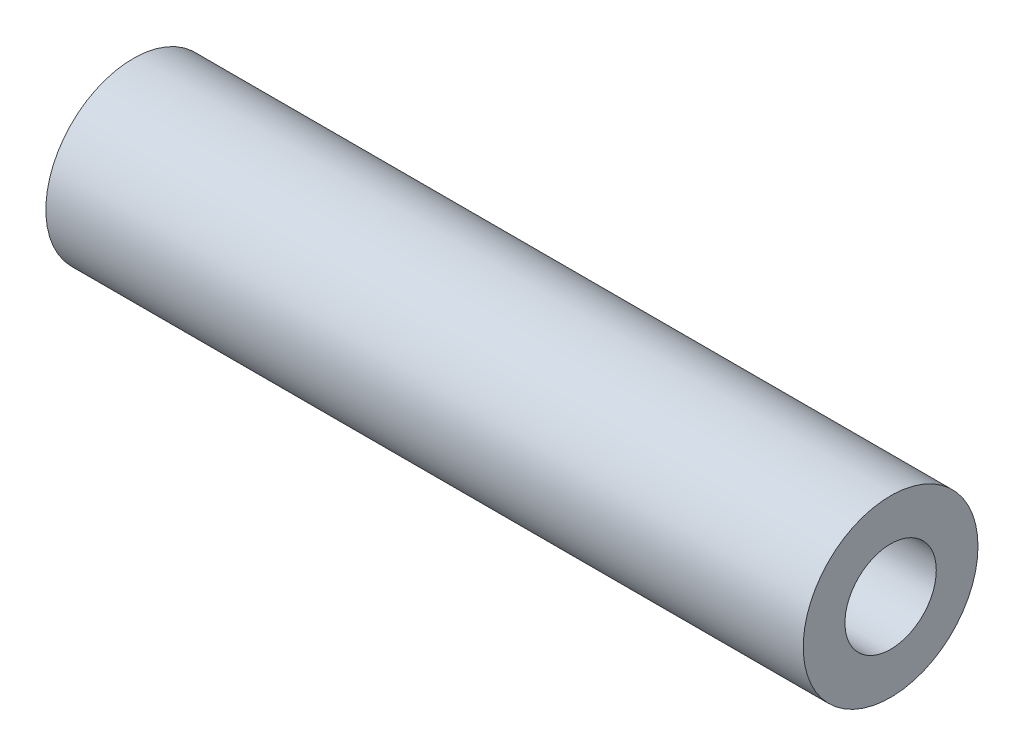
ISO-10303-21;
HEADER;
FILE_DESCRIPTION(('STEP AP214'),'2;1');
FILE_NAME('part.step','',(''),(''),'','','');
FILE_SCHEMA(('AUTOMOTIVE_DESIGN { 1 0 10303 214 1 1 1 1 }'));
ENDSEC;
DATA;
#1=APPLICATION_CONTEXT('core data for automotive mechanical design processes');
#2=APPLICATION_PROTOCOL_DEFINITION('international standard','automotive_design',2000,#1);
#3=PRODUCT_CONTEXT('',#1,'mechanical');
#4=PRODUCT('Part','Part','',(#3));
#5=PRODUCT_RELATED_PRODUCT_CATEGORY('part','',(#4));
#6=PRODUCT_DEFINITION_FORMATION('','',#4);
#7=PRODUCT_DEFINITION_CONTEXT('part definition',#1,'design');
#8=PRODUCT_DEFINITION('design','',#6,#7);
#9=PRODUCT_DEFINITION_SHAPE('','',#8);
#10=(LENGTH_UNIT() NAMED_UNIT(*) SI_UNIT(.MILLI.,.METRE.));
#11=(NAMED_UNIT(*) PLANE_ANGLE_UNIT() SI_UNIT($,.RADIAN.));
#12=(NAMED_UNIT(*) SI_UNIT($,.STERADIAN.) SOLID_ANGLE_UNIT());
#13=UNCERTAINTY_MEASURE_WITH_UNIT(LENGTH_MEASURE(1.E-05),#10,'distance_accuracy_value','');
#14=(GEOMETRIC_REPRESENTATION_CONTEXT(3) GLOBAL_UNCERTAINTY_ASSIGNED_CONTEXT((#13)) GLOBAL_UNIT_ASSIGNED_CONTEXT((#10,
#11,#12)) REPRESENTATION_CONTEXT('',''));
#15=CARTESIAN_POINT('',(0.,0.,0.));
#16=DIRECTION('',(0.,0.,1.));
#17=DIRECTION('',(1.,0.,0.));
#18=AXIS2_PLACEMENT_3D('',#15,#16,#17);
#19=CARTESIAN_POINT('',(34.1546158183962,0.,0.));
#20=DIRECTION('',(1.,0.,0.));
#21=DIRECTION('',(0.,0.,1.));
#22=AXIS2_PLACEMENT_3D('',#19,#20,#21);
#23=CYLINDRICAL_SURFACE('',#22,4.7625);
#24=CARTESIAN_POINT('',(88.9,0.,0.));
#25=DIRECTION('',(1.,0.,0.));
#26=DIRECTION('',(0.,0.,-1.));
#27=AXIS2_PLACEMENT_3D('',#24,#25,#26);
#28=CIRCLE('',#27,4.7625);
#29=CARTESIAN_POINT('',(88.9,0.,-4.7625));
#30=VERTEX_POINT('',#29);
#31=EDGE_CURVE('E44',#30,#30,#28,.T.);
#32=ORIENTED_EDGE('',*,*,#31,.F.);
#33=EDGE_LOOP('',(#32));
#34=FACE_BOUND('',#33,.T.);
#35=CARTESIAN_POINT('',(47.625,0.,0.));
#36=DIRECTION('',(1.,0.,0.));
#37=DIRECTION('',(0.,0.,-1.));
#38=AXIS2_PLACEMENT_3D('',#35,#36,#37);
#39=CIRCLE('',#38,4.7625);
#40=CARTESIAN_POINT('',(47.625,0.,-4.7625));
#41=VERTEX_POINT('',#40);
#42=EDGE_CURVE('E10',#41,#41,#39,.T.);
#43=ORIENTED_EDGE('',*,*,#42,.T.);
#44=EDGE_LOOP('',(#43));
#45=FACE_BOUND('',#44,.T.);
#46=ADVANCED_FACE('F37',(#34,#45),#23,.T.);
#47=CARTESIAN_POINT('',(88.9,0.,0.));
#48=DIRECTION('',(-1.,0.,0.));
#49=DIRECTION('',(0.,0.,-1.));
#50=AXIS2_PLACEMENT_3D('',#47,#48,#49);
#51=PLANE('',#50);
#52=ORIENTED_EDGE('',*,*,#31,.T.);
#53=EDGE_LOOP('',(#52));
#54=FACE_BOUND('',#53,.T.);
#55=CARTESIAN_POINT('',(88.9,0.,0.));
#56=DIRECTION('',(1.,0.,0.));
#57=DIRECTION('',(0.,0.,-1.));
#58=AXIS2_PLACEMENT_3D('',#55,#56,#57);
#59=CIRCLE('',#58,2.4892);
#60=CARTESIAN_POINT('',(88.9,0.,-2.4892));
#61=VERTEX_POINT('',#60);
#62=EDGE_CURVE('E49',#61,#61,#59,.T.);
#63=ORIENTED_EDGE('',*,*,#62,.F.);
#64=EDGE_LOOP('',(#63));
#65=FACE_BOUND('',#64,.T.);
#66=ADVANCED_FACE('F62',(#54,#65),#51,.F.);
#67=CARTESIAN_POINT('',(34.1546158183962,0.,0.));
#68=DIRECTION('',(1.,0.,0.));
#69=DIRECTION('',(0.,0.,1.));
#70=AXIS2_PLACEMENT_3D('',#67,#68,#69);
#71=CYLINDRICAL_SURFACE('',#70,2.4892);
#72=ORIENTED_EDGE('',*,*,#62,.T.);
#73=EDGE_LOOP('',(#72));
#74=FACE_BOUND('',#73,.T.);
#75=CARTESIAN_POINT('',(47.625,0.,0.));
#76=DIRECTION('',(1.,0.,0.));
#77=DIRECTION('',(0.,0.,-1.));
#78=AXIS2_PLACEMENT_3D('',#75,#76,#77);
#79=CIRCLE('',#78,2.4892);
#80=CARTESIAN_POINT('',(47.625,0.,-2.4892));
#81=VERTEX_POINT('',#80);
#82=EDGE_CURVE('E40',#81,#81,#79,.T.);
#83=ORIENTED_EDGE('',*,*,#82,.F.);
#84=EDGE_LOOP('',(#83));
#85=FACE_BOUND('',#84,.T.);
#86=ADVANCED_FACE('F60',(#74,#85),#71,.F.);
#87=CARTESIAN_POINT('',(47.625,23.8125,-19.05));
#88=DIRECTION('',(-1.,0.,0.));
#89=DIRECTION('',(0.,0.,-1.));
#90=AXIS2_PLACEMENT_3D('',#87,#88,#89);
#91=PLANE('',#90);
#92=ORIENTED_EDGE('',*,*,#82,.T.);
#93=EDGE_LOOP('',(#92));
#94=FACE_BOUND('',#93,.T.);
#95=ORIENTED_EDGE('',*,*,#42,.F.);
#96=EDGE_LOOP('',(#95));
#97=FACE_BOUND('',#96,.T.);
#98=ADVANCED_FACE('F57',(#94,#97),#91,.T.);
#99=CLOSED_SHELL('',(#46,#66,#86,#98));
#100=MANIFOLD_SOLID_BREP('B2',#99);
#101=ADVANCED_BREP_SHAPE_REPRESENTATION('',(#18,#100),#14);
#102=SHAPE_DEFINITION_REPRESENTATION(#9,#101);
ENDSEC;
END-ISO-10303-21;
